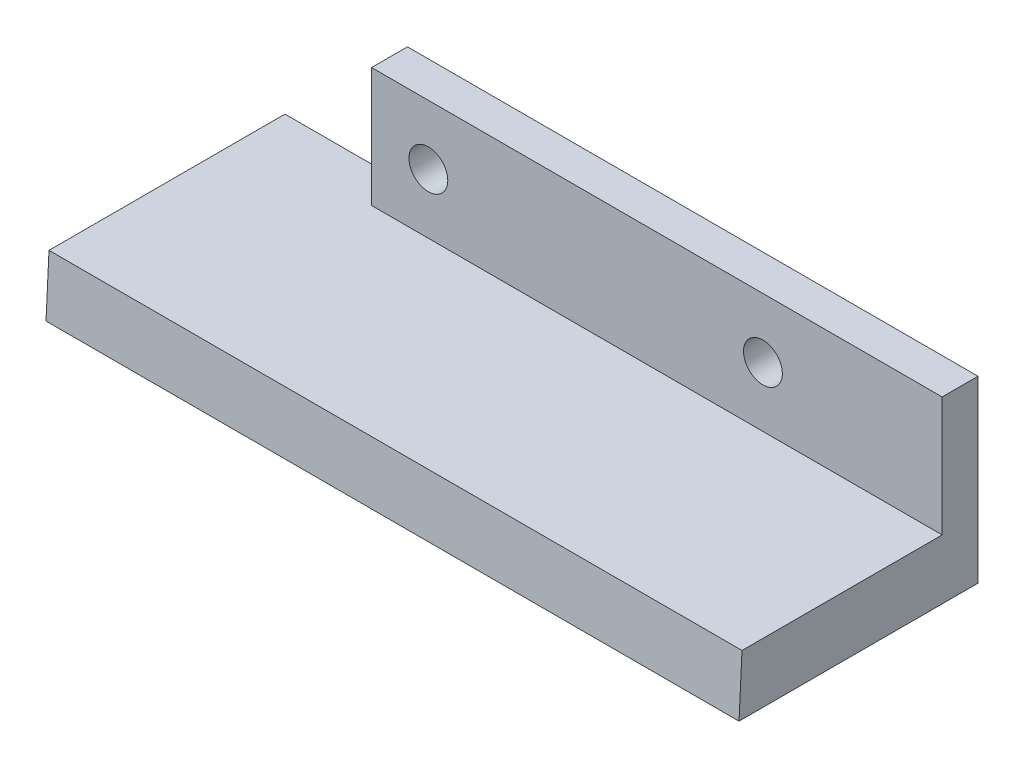
ISO-10303-21;
HEADER;
FILE_DESCRIPTION(('STEP AP214'),'2;1');
FILE_NAME('part.step','',(''),(''),'','','');
FILE_SCHEMA(('AUTOMOTIVE_DESIGN { 1 0 10303 214 1 1 1 1 }'));
ENDSEC;
DATA;
#1=APPLICATION_CONTEXT('core data for automotive mechanical design processes');
#2=APPLICATION_PROTOCOL_DEFINITION('international standard','automotive_design',2000,#1);
#3=PRODUCT_CONTEXT('',#1,'mechanical');
#4=PRODUCT('Part','Part','',(#3));
#5=PRODUCT_RELATED_PRODUCT_CATEGORY('part','',(#4));
#6=PRODUCT_DEFINITION_FORMATION('','',#4);
#7=PRODUCT_DEFINITION_CONTEXT('part definition',#1,'design');
#8=PRODUCT_DEFINITION('design','',#6,#7);
#9=PRODUCT_DEFINITION_SHAPE('','',#8);
#10=(LENGTH_UNIT() NAMED_UNIT(*) SI_UNIT(.MILLI.,.METRE.));
#11=(NAMED_UNIT(*) PLANE_ANGLE_UNIT() SI_UNIT($,.RADIAN.));
#12=(NAMED_UNIT(*) SI_UNIT($,.STERADIAN.) SOLID_ANGLE_UNIT());
#13=UNCERTAINTY_MEASURE_WITH_UNIT(LENGTH_MEASURE(1.E-05),#10,'distance_accuracy_value','');
#14=(GEOMETRIC_REPRESENTATION_CONTEXT(3) GLOBAL_UNCERTAINTY_ASSIGNED_CONTEXT((#13)) GLOBAL_UNIT_ASSIGNED_CONTEXT((#10,
#11,#12)) REPRESENTATION_CONTEXT('',''));
#15=CARTESIAN_POINT('',(0.,0.,0.));
#16=DIRECTION('',(0.,0.,1.));
#17=DIRECTION('',(1.,0.,0.));
#18=AXIS2_PLACEMENT_3D('',#15,#16,#17);
#19=CARTESIAN_POINT('',(0.,0.,20.));
#20=DIRECTION('',(0.,-1.,0.));
#21=DIRECTION('',(0.,0.,-1.));
#22=AXIS2_PLACEMENT_3D('',#19,#20,#21);
#23=PLANE('',#22);
#24=DIRECTION('',(0.,0.,-1.));
#25=VECTOR('',#24,1.);
#26=CARTESIAN_POINT('',(0.,0.,20.));
#27=LINE('',#26,#25);
#28=CARTESIAN_POINT('',(0.,0.,19.75));
#29=VERTEX_POINT('',#28);
#30=CARTESIAN_POINT('',(0.,0.,0.));
#31=VERTEX_POINT('',#30);
#32=EDGE_CURVE('E104',#29,#31,#27,.T.);
#33=ORIENTED_EDGE('',*,*,#32,.F.);
#34=DIRECTION('',(1.,0.,0.));
#35=VECTOR('',#34,1.);
#36=CARTESIAN_POINT('',(0.,0.,19.75));
#37=LINE('',#36,#35);
#38=CARTESIAN_POINT('',(58.,0.,19.75));
#39=VERTEX_POINT('',#38);
#40=EDGE_CURVE('E91',#29,#39,#37,.T.);
#41=ORIENTED_EDGE('',*,*,#40,.T.);
#42=DIRECTION('',(0.,0.,-1.));
#43=VECTOR('',#42,1.);
#44=CARTESIAN_POINT('',(58.,0.,20.));
#45=LINE('',#44,#43);
#46=CARTESIAN_POINT('',(58.,0.,3.));
#47=VERTEX_POINT('',#46);
#48=EDGE_CURVE('E48',#39,#47,#45,.T.);
#49=ORIENTED_EDGE('',*,*,#48,.T.);
#50=DIRECTION('',(1.,0.,0.));
#51=VECTOR('',#50,1.);
#52=CARTESIAN_POINT('',(58.,0.,3.));
#53=LINE('',#52,#51);
#54=CARTESIAN_POINT('',(10.25,0.,3.00000000000001));
#55=VERTEX_POINT('',#54);
#56=EDGE_CURVE('E143',#55,#47,#53,.T.);
#57=ORIENTED_EDGE('',*,*,#56,.F.);
#58=DIRECTION('',(0.,0.,1.));
#59=VECTOR('',#58,1.);
#60=CARTESIAN_POINT('',(10.25,0.,0.));
#61=LINE('',#60,#59);
#62=CARTESIAN_POINT('',(10.25,0.,0.));
#63=VERTEX_POINT('',#62);
#64=EDGE_CURVE('E54',#63,#55,#61,.T.);
#65=ORIENTED_EDGE('',*,*,#64,.F.);
#66=DIRECTION('',(-1.,0.,0.));
#67=VECTOR('',#66,1.);
#68=CARTESIAN_POINT('',(0.,0.,0.));
#69=LINE('',#68,#67);
#70=EDGE_CURVE('E106',#63,#31,#69,.T.);
#71=ORIENTED_EDGE('',*,*,#70,.T.);
#72=EDGE_LOOP('',(#33,#41,#49,#57,#65,#71));
#73=FACE_BOUND('',#72,.T.);
#74=ADVANCED_FACE('F33',(#73),#23,.F.);
#75=CARTESIAN_POINT('',(0.,0.,20.));
#76=DIRECTION('',(1.,0.,0.));
#77=DIRECTION('',(0.,1.,0.));
#78=AXIS2_PLACEMENT_3D('',#75,#76,#77);
#79=PLANE('',#78);
#80=DIRECTION('',(0.,0.,-1.));
#81=VECTOR('',#80,1.);
#82=CARTESIAN_POINT('',(0.,-5.,20.));
#83=LINE('',#82,#81);
#84=CARTESIAN_POINT('',(0.,-5.,20.));
#85=VERTEX_POINT('',#84);
#86=CARTESIAN_POINT('',(0.,-5.,0.));
#87=VERTEX_POINT('',#86);
#88=EDGE_CURVE('E11',#85,#87,#83,.T.);
#89=ORIENTED_EDGE('',*,*,#88,.F.);
#90=DIRECTION('',(0.,0.998752338877845,-0.0499376169438923));
#91=VECTOR('',#90,1.);
#92=CARTESIAN_POINT('',(0.,-5.,20.));
#93=LINE('',#92,#91);
#94=EDGE_CURVE('E94',#85,#29,#93,.T.);
#95=ORIENTED_EDGE('',*,*,#94,.T.);
#96=ORIENTED_EDGE('',*,*,#32,.T.);
#97=DIRECTION('',(0.,-1.,0.));
#98=VECTOR('',#97,1.);
#99=CARTESIAN_POINT('',(0.,0.,0.));
#100=LINE('',#99,#98);
#101=EDGE_CURVE('E129',#31,#87,#100,.T.);
#102=ORIENTED_EDGE('',*,*,#101,.T.);
#103=EDGE_LOOP('',(#89,#95,#96,#102));
#104=FACE_BOUND('',#103,.T.);
#105=ADVANCED_FACE('F35',(#104),#79,.F.);
#106=CARTESIAN_POINT('',(0.,-5.,20.));
#107=DIRECTION('',(0.,1.,0.));
#108=DIRECTION('',(0.,0.,1.));
#109=AXIS2_PLACEMENT_3D('',#106,#107,#108);
#110=PLANE('',#109);
#111=DIRECTION('',(1.,0.,0.));
#112=VECTOR('',#111,1.);
#113=CARTESIAN_POINT('',(0.,-5.,0.));
#114=LINE('',#113,#112);
#115=CARTESIAN_POINT('',(58.,-5.,0.));
#116=VERTEX_POINT('',#115);
#117=EDGE_CURVE('E125',#87,#116,#114,.T.);
#118=ORIENTED_EDGE('',*,*,#117,.T.);
#119=DIRECTION('',(0.,0.,-1.));
#120=VECTOR('',#119,1.);
#121=CARTESIAN_POINT('',(58.,-5.,20.));
#122=LINE('',#121,#120);
#123=CARTESIAN_POINT('',(58.,-5.,20.));
#124=VERTEX_POINT('',#123);
#125=EDGE_CURVE('E41',#124,#116,#122,.T.);
#126=ORIENTED_EDGE('',*,*,#125,.F.);
#127=DIRECTION('',(1.,0.,0.));
#128=VECTOR('',#127,1.);
#129=CARTESIAN_POINT('',(0.,-5.,20.));
#130=LINE('',#129,#128);
#131=EDGE_CURVE('E108',#85,#124,#130,.T.);
#132=ORIENTED_EDGE('',*,*,#131,.F.);
#133=ORIENTED_EDGE('',*,*,#88,.T.);
#134=EDGE_LOOP('',(#118,#126,#132,#133));
#135=FACE_BOUND('',#134,.T.);
#136=ADVANCED_FACE('F194',(#135),#110,.F.);
#137=CARTESIAN_POINT('',(58.,0.,20.));
#138=DIRECTION('',(-1.,0.,0.));
#139=DIRECTION('',(0.,0.,1.));
#140=AXIS2_PLACEMENT_3D('',#137,#138,#139);
#141=PLANE('',#140);
#142=ORIENTED_EDGE('',*,*,#48,.F.);
#143=DIRECTION('',(0.,0.998752338877845,-0.0499376169438923));
#144=VECTOR('',#143,1.);
#145=CARTESIAN_POINT('',(58.,-5.,20.));
#146=LINE('',#145,#144);
#147=EDGE_CURVE('E97',#124,#39,#146,.T.);
#148=ORIENTED_EDGE('',*,*,#147,.F.);
#149=ORIENTED_EDGE('',*,*,#125,.T.);
#150=DIRECTION('',(0.,1.,0.));
#151=VECTOR('',#150,1.);
#152=CARTESIAN_POINT('',(58.,0.,0.));
#153=LINE('',#152,#151);
#154=CARTESIAN_POINT('',(58.,10.,0.));
#155=VERTEX_POINT('',#154);
#156=EDGE_CURVE('E120',#116,#155,#153,.T.);
#157=ORIENTED_EDGE('',*,*,#156,.T.);
#158=DIRECTION('',(0.,0.,-1.));
#159=VECTOR('',#158,1.);
#160=CARTESIAN_POINT('',(58.,10.,0.));
#161=LINE('',#160,#159);
#162=CARTESIAN_POINT('',(58.,10.,3.));
#163=VERTEX_POINT('',#162);
#164=EDGE_CURVE('E145',#163,#155,#161,.T.);
#165=ORIENTED_EDGE('',*,*,#164,.F.);
#166=DIRECTION('',(0.,-1.,0.));
#167=VECTOR('',#166,1.);
#168=CARTESIAN_POINT('',(58.,10.,3.));
#169=LINE('',#168,#167);
#170=EDGE_CURVE('E139',#163,#47,#169,.T.);
#171=ORIENTED_EDGE('',*,*,#170,.T.);
#172=EDGE_LOOP('',(#142,#148,#149,#157,#165,#171));
#173=FACE_BOUND('',#172,.T.);
#174=ADVANCED_FACE('F118',(#173),#141,.F.);
#175=CARTESIAN_POINT('',(0.,0.,0.));
#176=DIRECTION('',(0.,0.,1.));
#177=DIRECTION('',(1.,0.,0.));
#178=AXIS2_PLACEMENT_3D('',#175,#176,#177);
#179=PLANE('',#178);
#180=CARTESIAN_POINT('',(43.,5.,0.));
#181=DIRECTION('',(0.,0.,1.));
#182=DIRECTION('',(1.,0.,0.));
#183=AXIS2_PLACEMENT_3D('',#180,#181,#182);
#184=CIRCLE('',#183,1.625);
#185=CARTESIAN_POINT('',(44.625,5.,0.));
#186=VERTEX_POINT('',#185);
#187=EDGE_CURVE('E147',#186,#186,#184,.T.);
#188=ORIENTED_EDGE('',*,*,#187,.T.);
#189=EDGE_LOOP('',(#188));
#190=FACE_BOUND('',#189,.T.);
#191=CARTESIAN_POINT('',(15.,5.,0.));
#192=DIRECTION('',(0.,0.,1.));
#193=DIRECTION('',(1.,0.,0.));
#194=AXIS2_PLACEMENT_3D('',#191,#192,#193);
#195=CIRCLE('',#194,1.625);
#196=CARTESIAN_POINT('',(16.625,5.,0.));
#197=VERTEX_POINT('',#196);
#198=EDGE_CURVE('E155',#197,#197,#195,.T.);
#199=ORIENTED_EDGE('',*,*,#198,.T.);
#200=EDGE_LOOP('',(#199));
#201=FACE_BOUND('',#200,.T.);
#202=ORIENTED_EDGE('',*,*,#101,.F.);
#203=ORIENTED_EDGE('',*,*,#70,.F.);
#204=DIRECTION('',(0.,-1.,0.));
#205=VECTOR('',#204,1.);
#206=CARTESIAN_POINT('',(10.25,10.,0.));
#207=LINE('',#206,#205);
#208=CARTESIAN_POINT('',(10.25,10.,0.));
#209=VERTEX_POINT('',#208);
#210=EDGE_CURVE('E132',#209,#63,#207,.T.);
#211=ORIENTED_EDGE('',*,*,#210,.F.);
#212=DIRECTION('',(-1.,0.,0.));
#213=VECTOR('',#212,1.);
#214=CARTESIAN_POINT('',(58.,10.,0.));
#215=LINE('',#214,#213);
#216=EDGE_CURVE('E127',#155,#209,#215,.T.);
#217=ORIENTED_EDGE('',*,*,#216,.F.);
#218=ORIENTED_EDGE('',*,*,#156,.F.);
#219=ORIENTED_EDGE('',*,*,#117,.F.);
#220=EDGE_LOOP('',(#202,#203,#211,#217,#218,#219));
#221=FACE_BOUND('',#220,.T.);
#222=ADVANCED_FACE('F124',(#190,#201,#221),#179,.F.);
#223=CARTESIAN_POINT('',(10.25,10.,0.));
#224=DIRECTION('',(1.,0.,0.));
#225=DIRECTION('',(0.,0.,-1.));
#226=AXIS2_PLACEMENT_3D('',#223,#224,#225);
#227=PLANE('',#226);
#228=ORIENTED_EDGE('',*,*,#64,.T.);
#229=DIRECTION('',(0.,-1.,0.));
#230=VECTOR('',#229,1.);
#231=CARTESIAN_POINT('',(10.25,10.,3.00000000000001));
#232=LINE('',#231,#230);
#233=CARTESIAN_POINT('',(10.25,10.,3.00000000000001));
#234=VERTEX_POINT('',#233);
#235=EDGE_CURVE('E136',#234,#55,#232,.T.);
#236=ORIENTED_EDGE('',*,*,#235,.F.);
#237=DIRECTION('',(0.,0.,1.));
#238=VECTOR('',#237,1.);
#239=CARTESIAN_POINT('',(10.25,10.,0.));
#240=LINE('',#239,#238);
#241=EDGE_CURVE('E149',#209,#234,#240,.T.);
#242=ORIENTED_EDGE('',*,*,#241,.F.);
#243=ORIENTED_EDGE('',*,*,#210,.T.);
#244=EDGE_LOOP('',(#228,#236,#242,#243));
#245=FACE_BOUND('',#244,.T.);
#246=ADVANCED_FACE('F172',(#245),#227,.F.);
#247=CARTESIAN_POINT('',(58.,10.,3.));
#248=DIRECTION('',(0.,0.,-1.));
#249=DIRECTION('',(-1.,0.,0.));
#250=AXIS2_PLACEMENT_3D('',#247,#248,#249);
#251=PLANE('',#250);
#252=CARTESIAN_POINT('',(43.,5.,3.00000000000001));
#253=DIRECTION('',(0.,0.,1.));
#254=DIRECTION('',(1.,0.,0.));
#255=AXIS2_PLACEMENT_3D('',#252,#253,#254);
#256=CIRCLE('',#255,1.625);
#257=CARTESIAN_POINT('',(44.625,5.,3.00000000000001));
#258=VERTEX_POINT('',#257);
#259=EDGE_CURVE('E158',#258,#258,#256,.T.);
#260=ORIENTED_EDGE('',*,*,#259,.F.);
#261=EDGE_LOOP('',(#260));
#262=FACE_BOUND('',#261,.T.);
#263=CARTESIAN_POINT('',(15.,5.,3.00000000000001));
#264=DIRECTION('',(0.,0.,1.));
#265=DIRECTION('',(1.,0.,0.));
#266=AXIS2_PLACEMENT_3D('',#263,#264,#265);
#267=CIRCLE('',#266,1.625);
#268=CARTESIAN_POINT('',(16.625,5.,3.00000000000001));
#269=VERTEX_POINT('',#268);
#270=EDGE_CURVE('E99',#269,#269,#267,.T.);
#271=ORIENTED_EDGE('',*,*,#270,.F.);
#272=EDGE_LOOP('',(#271));
#273=FACE_BOUND('',#272,.T.);
#274=ORIENTED_EDGE('',*,*,#56,.T.);
#275=ORIENTED_EDGE('',*,*,#170,.F.);
#276=DIRECTION('',(1.,0.,0.));
#277=VECTOR('',#276,1.);
#278=CARTESIAN_POINT('',(58.,10.,3.));
#279=LINE('',#278,#277);
#280=EDGE_CURVE('E142',#234,#163,#279,.T.);
#281=ORIENTED_EDGE('',*,*,#280,.F.);
#282=ORIENTED_EDGE('',*,*,#235,.T.);
#283=EDGE_LOOP('',(#274,#275,#281,#282));
#284=FACE_BOUND('',#283,.T.);
#285=ADVANCED_FACE('F168',(#262,#273,#284),#251,.F.);
#286=CARTESIAN_POINT('',(0.,10.,0.));
#287=DIRECTION('',(0.,-1.,0.));
#288=DIRECTION('',(0.,0.,-1.));
#289=AXIS2_PLACEMENT_3D('',#286,#287,#288);
#290=PLANE('',#289);
#291=ORIENTED_EDGE('',*,*,#164,.T.);
#292=ORIENTED_EDGE('',*,*,#216,.T.);
#293=ORIENTED_EDGE('',*,*,#241,.T.);
#294=ORIENTED_EDGE('',*,*,#280,.T.);
#295=EDGE_LOOP('',(#291,#292,#293,#294));
#296=FACE_BOUND('',#295,.T.);
#297=ADVANCED_FACE('F171',(#296),#290,.F.);
#298=CARTESIAN_POINT('',(15.,5.,-6.99999999999999));
#299=DIRECTION('',(0.,0.,1.));
#300=DIRECTION('',(1.,0.,0.));
#301=AXIS2_PLACEMENT_3D('',#298,#299,#300);
#302=CYLINDRICAL_SURFACE('',#301,1.625);
#303=ORIENTED_EDGE('',*,*,#270,.T.);
#304=EDGE_LOOP('',(#303));
#305=FACE_BOUND('',#304,.T.);
#306=ORIENTED_EDGE('',*,*,#198,.F.);
#307=EDGE_LOOP('',(#306));
#308=FACE_BOUND('',#307,.T.);
#309=ADVANCED_FACE('F228',(#305,#308),#302,.F.);
#310=CARTESIAN_POINT('',(43.,5.,-6.99999999999999));
#311=DIRECTION('',(0.,0.,1.));
#312=DIRECTION('',(1.,0.,0.));
#313=AXIS2_PLACEMENT_3D('',#310,#311,#312);
#314=CYLINDRICAL_SURFACE('',#313,1.625);
#315=ORIENTED_EDGE('',*,*,#259,.T.);
#316=EDGE_LOOP('',(#315));
#317=FACE_BOUND('',#316,.T.);
#318=ORIENTED_EDGE('',*,*,#187,.F.);
#319=EDGE_LOOP('',(#318));
#320=FACE_BOUND('',#319,.T.);
#321=ADVANCED_FACE('F165',(#317,#320),#314,.F.);
#322=CARTESIAN_POINT('',(0.,-5.,20.));
#323=DIRECTION('',(0.,-0.0499376169438923,-0.998752338877845));
#324=DIRECTION('',(0.,0.998752338877845,-0.0499376169438923));
#325=AXIS2_PLACEMENT_3D('',#322,#323,#324);
#326=PLANE('',#325);
#327=ORIENTED_EDGE('',*,*,#147,.T.);
#328=ORIENTED_EDGE('',*,*,#40,.F.);
#329=ORIENTED_EDGE('',*,*,#94,.F.);
#330=ORIENTED_EDGE('',*,*,#131,.T.);
#331=EDGE_LOOP('',(#327,#328,#329,#330));
#332=FACE_BOUND('',#331,.T.);
#333=ADVANCED_FACE('F93',(#332),#326,.F.);
#334=CLOSED_SHELL('',(#74,#105,#136,#174,#222,#246,#285,#297,#309,#321,#333));
#335=MANIFOLD_SOLID_BREP('B2',#334);
#336=ADVANCED_BREP_SHAPE_REPRESENTATION('',(#18,#335),#14);
#337=SHAPE_DEFINITION_REPRESENTATION(#9,#336);
ENDSEC;
END-ISO-10303-21;
